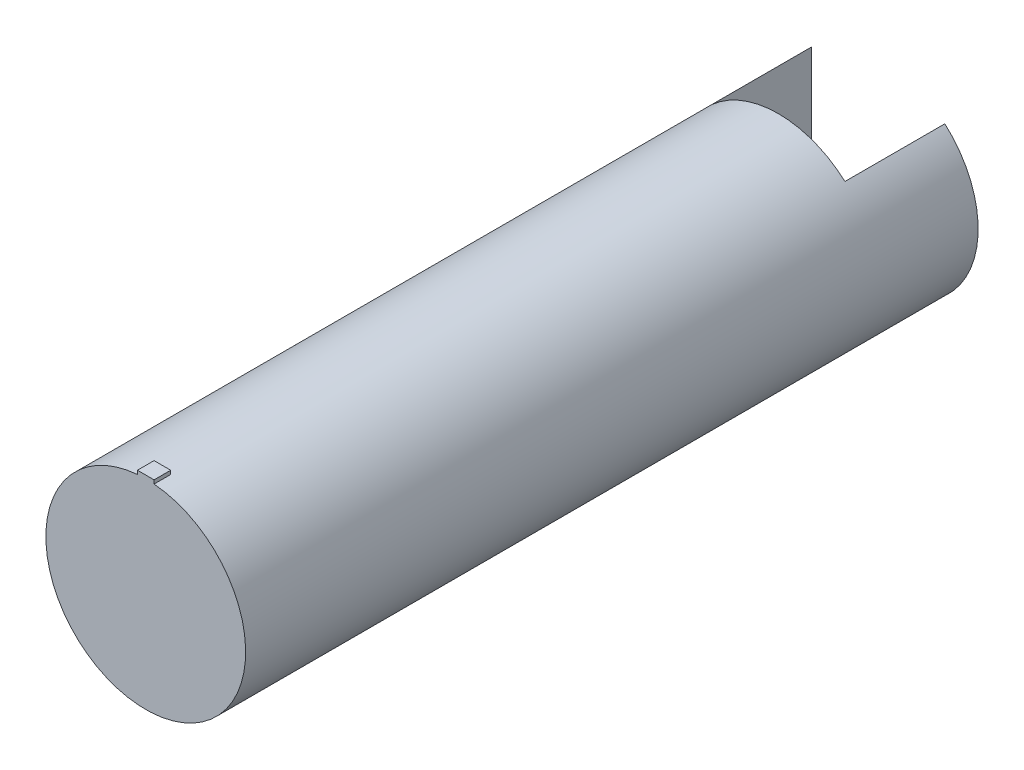
ISO-10303-21;
HEADER;
FILE_DESCRIPTION(('STEP AP214'),'2;1');
FILE_NAME('part.step','',(''),(''),'','','');
FILE_SCHEMA(('AUTOMOTIVE_DESIGN { 1 0 10303 214 1 1 1 1 }'));
ENDSEC;
DATA;
#1=APPLICATION_CONTEXT('core data for automotive mechanical design processes');
#2=APPLICATION_PROTOCOL_DEFINITION('international standard','automotive_design',2000,#1);
#3=PRODUCT_CONTEXT('',#1,'mechanical');
#4=PRODUCT('Part','Part','',(#3));
#5=PRODUCT_RELATED_PRODUCT_CATEGORY('part','',(#4));
#6=PRODUCT_DEFINITION_FORMATION('','',#4);
#7=PRODUCT_DEFINITION_CONTEXT('part definition',#1,'design');
#8=PRODUCT_DEFINITION('design','',#6,#7);
#9=PRODUCT_DEFINITION_SHAPE('','',#8);
#10=(LENGTH_UNIT() NAMED_UNIT(*) SI_UNIT(.MILLI.,.METRE.));
#11=(NAMED_UNIT(*) PLANE_ANGLE_UNIT() SI_UNIT($,.RADIAN.));
#12=(NAMED_UNIT(*) SI_UNIT($,.STERADIAN.) SOLID_ANGLE_UNIT());
#13=UNCERTAINTY_MEASURE_WITH_UNIT(LENGTH_MEASURE(1.E-05),#10,'distance_accuracy_value','');
#14=(GEOMETRIC_REPRESENTATION_CONTEXT(3) GLOBAL_UNCERTAINTY_ASSIGNED_CONTEXT((#13)) GLOBAL_UNIT_ASSIGNED_CONTEXT((#10,
#11,#12)) REPRESENTATION_CONTEXT('',''));
#15=CARTESIAN_POINT('',(0.,0.,0.));
#16=DIRECTION('',(0.,0.,1.));
#17=DIRECTION('',(1.,0.,0.));
#18=AXIS2_PLACEMENT_3D('',#15,#16,#17);
#19=CARTESIAN_POINT('',(0.,0.,220.));
#20=DIRECTION('',(0.,0.,-1.));
#21=DIRECTION('',(-1.,0.,0.));
#22=AXIS2_PLACEMENT_3D('',#19,#20,#21);
#23=CYLINDRICAL_SURFACE('',#22,30.);
#24=DIRECTION('',(0.,0.,-1.));
#25=VECTOR('',#24,1.);
#26=CARTESIAN_POINT('',(20.,22.3606797749979,220.));
#27=LINE('',#26,#25);
#28=CARTESIAN_POINT('',(20.,22.3606797749979,30.));
#29=VERTEX_POINT('',#28);
#30=CARTESIAN_POINT('',(20.,22.3606797749979,0.));
#31=VERTEX_POINT('',#30);
#32=EDGE_CURVE('E150',#29,#31,#27,.T.);
#33=ORIENTED_EDGE('',*,*,#32,.F.);
#34=CARTESIAN_POINT('',(0.,0.,30.));
#35=DIRECTION('',(0.,0.,1.));
#36=DIRECTION('',(1.,0.,0.));
#37=AXIS2_PLACEMENT_3D('',#34,#35,#36);
#38=CIRCLE('',#37,30.);
#39=CARTESIAN_POINT('',(-20.,22.3606797749979,30.));
#40=VERTEX_POINT('',#39);
#41=EDGE_CURVE('E40',#29,#40,#38,.T.);
#42=ORIENTED_EDGE('',*,*,#41,.T.);
#43=DIRECTION('',(0.,0.,-1.));
#44=VECTOR('',#43,1.);
#45=CARTESIAN_POINT('',(-20.,22.3606797749979,220.));
#46=LINE('',#45,#44);
#47=CARTESIAN_POINT('',(-20.,22.3606797749979,0.));
#48=VERTEX_POINT('',#47);
#49=EDGE_CURVE('E145',#48,#40,#46,.F.);
#50=ORIENTED_EDGE('',*,*,#49,.F.);
#51=CARTESIAN_POINT('',(0.,0.,0.));
#52=DIRECTION('',(0.,0.,1.));
#53=DIRECTION('',(1.,0.,0.));
#54=AXIS2_PLACEMENT_3D('',#51,#52,#53);
#55=CIRCLE('',#54,30.);
#56=CARTESIAN_POINT('',(-20.,-22.3606797749979,0.));
#57=VERTEX_POINT('',#56);
#58=EDGE_CURVE('E156',#48,#57,#55,.T.);
#59=ORIENTED_EDGE('',*,*,#58,.T.);
#60=DIRECTION('',(0.,0.,-1.));
#61=VECTOR('',#60,1.);
#62=CARTESIAN_POINT('',(-20.,-22.3606797749979,220.));
#63=LINE('',#62,#61);
#64=CARTESIAN_POINT('',(-20.,-22.3606797749979,30.));
#65=VERTEX_POINT('',#64);
#66=EDGE_CURVE('E55',#65,#57,#63,.T.);
#67=ORIENTED_EDGE('',*,*,#66,.F.);
#68=CARTESIAN_POINT('',(20.,-22.3606797749979,30.));
#69=VERTEX_POINT('',#68);
#70=EDGE_CURVE('E161',#65,#69,#38,.T.);
#71=ORIENTED_EDGE('',*,*,#70,.T.);
#72=DIRECTION('',(0.,0.,-1.));
#73=VECTOR('',#72,1.);
#74=CARTESIAN_POINT('',(20.,-22.3606797749979,220.));
#75=LINE('',#74,#73);
#76=CARTESIAN_POINT('',(20.,-22.3606797749979,0.));
#77=VERTEX_POINT('',#76);
#78=EDGE_CURVE('E148',#77,#69,#75,.F.);
#79=ORIENTED_EDGE('',*,*,#78,.F.);
#80=EDGE_CURVE('E152',#77,#31,#55,.T.);
#81=ORIENTED_EDGE('',*,*,#80,.T.);
#82=EDGE_LOOP('',(#33,#42,#50,#59,#67,#71,#79,#81));
#83=FACE_BOUND('',#82,.T.);
#84=DIRECTION('',(0.,0.,-1.));
#85=VECTOR('',#84,1.);
#86=CARTESIAN_POINT('',(2.5,29.8956518577535,220.));
#87=LINE('',#86,#85);
#88=CARTESIAN_POINT('',(2.5,29.8956518577535,220.));
#89=VERTEX_POINT('',#88);
#90=CARTESIAN_POINT('',(2.5,29.8956518577535,215.));
#91=VERTEX_POINT('',#90);
#92=EDGE_CURVE('E120',#89,#91,#87,.T.);
#93=ORIENTED_EDGE('',*,*,#92,.F.);
#94=CARTESIAN_POINT('',(0.,0.,220.));
#95=DIRECTION('',(0.,0.,1.));
#96=DIRECTION('',(1.,0.,0.));
#97=AXIS2_PLACEMENT_3D('',#94,#95,#96);
#98=CIRCLE('',#97,30.);
#99=CARTESIAN_POINT('',(-2.5,29.8956518577535,220.));
#100=VERTEX_POINT('',#99);
#101=EDGE_CURVE('E153',#100,#89,#98,.T.);
#102=ORIENTED_EDGE('',*,*,#101,.F.);
#103=DIRECTION('',(0.,0.,-1.));
#104=VECTOR('',#103,1.);
#105=CARTESIAN_POINT('',(-2.5,29.8956518577535,220.));
#106=LINE('',#105,#104);
#107=CARTESIAN_POINT('',(-2.5,29.8956518577535,215.));
#108=VERTEX_POINT('',#107);
#109=EDGE_CURVE('E121',#108,#100,#106,.F.);
#110=ORIENTED_EDGE('',*,*,#109,.F.);
#111=CARTESIAN_POINT('',(0.,0.,215.));
#112=DIRECTION('',(0.,0.,1.));
#113=DIRECTION('',(1.,0.,0.));
#114=AXIS2_PLACEMENT_3D('',#111,#112,#113);
#115=CIRCLE('',#114,30.);
#116=EDGE_CURVE('E11',#91,#108,#115,.T.);
#117=ORIENTED_EDGE('',*,*,#116,.F.);
#118=EDGE_LOOP('',(#93,#102,#110,#117));
#119=FACE_BOUND('',#118,.T.);
#120=ADVANCED_FACE('F33',(#83,#119),#23,.T.);
#121=CARTESIAN_POINT('',(0.,0.,0.));
#122=DIRECTION('',(0.,0.,1.));
#123=DIRECTION('',(1.,0.,0.));
#124=AXIS2_PLACEMENT_3D('',#121,#122,#123);
#125=PLANE('',#124);
#126=DIRECTION('',(0.,-1.,0.));
#127=VECTOR('',#126,1.);
#128=CARTESIAN_POINT('',(20.,0.,0.));
#129=LINE('',#128,#127);
#130=EDGE_CURVE('E160',#31,#77,#129,.T.);
#131=ORIENTED_EDGE('',*,*,#130,.F.);
#132=ORIENTED_EDGE('',*,*,#80,.F.);
#133=EDGE_LOOP('',(#131,#132));
#134=FACE_BOUND('',#133,.T.);
#135=ADVANCED_FACE('F180',(#134),#125,.F.);
#136=DIRECTION('',(0.,1.,0.));
#137=VECTOR('',#136,1.);
#138=CARTESIAN_POINT('',(-20.,0.,0.));
#139=LINE('',#138,#137);
#140=EDGE_CURVE('E155',#57,#48,#139,.T.);
#141=ORIENTED_EDGE('',*,*,#140,.F.);
#142=ORIENTED_EDGE('',*,*,#58,.F.);
#143=EDGE_LOOP('',(#141,#142));
#144=FACE_BOUND('',#143,.T.);
#145=ADVANCED_FACE('F182',(#144),#125,.F.);
#146=CARTESIAN_POINT('',(0.,0.,220.));
#147=DIRECTION('',(0.,0.,1.));
#148=DIRECTION('',(1.,0.,0.));
#149=AXIS2_PLACEMENT_3D('',#146,#147,#148);
#150=PLANE('',#149);
#151=ORIENTED_EDGE('',*,*,#101,.T.);
#152=DIRECTION('',(0.,-1.,0.));
#153=VECTOR('',#152,1.);
#154=CARTESIAN_POINT('',(2.5,31.,220.));
#155=LINE('',#154,#153);
#156=CARTESIAN_POINT('',(2.5,31.,220.));
#157=VERTEX_POINT('',#156);
#158=EDGE_CURVE('E319',#157,#89,#155,.T.);
#159=ORIENTED_EDGE('',*,*,#158,.F.);
#160=DIRECTION('',(1.,0.,0.));
#161=VECTOR('',#160,1.);
#162=CARTESIAN_POINT('',(-2.5,31.,220.));
#163=LINE('',#162,#161);
#164=CARTESIAN_POINT('',(-2.5,31.,220.));
#165=VERTEX_POINT('',#164);
#166=EDGE_CURVE('E114',#165,#157,#163,.T.);
#167=ORIENTED_EDGE('',*,*,#166,.F.);
#168=DIRECTION('',(0.,-1.,0.));
#169=VECTOR('',#168,1.);
#170=CARTESIAN_POINT('',(-2.5,31.,220.));
#171=LINE('',#170,#169);
#172=EDGE_CURVE('E47',#165,#100,#171,.T.);
#173=ORIENTED_EDGE('',*,*,#172,.T.);
#174=EDGE_LOOP('',(#151,#159,#167,#173));
#175=FACE_BOUND('',#174,.T.);
#176=ADVANCED_FACE('F187',(#175),#150,.T.);
#177=CARTESIAN_POINT('',(0.,0.,30.));
#178=DIRECTION('',(0.,0.,1.));
#179=DIRECTION('',(1.,0.,0.));
#180=AXIS2_PLACEMENT_3D('',#177,#178,#179);
#181=PLANE('',#180);
#182=DIRECTION('',(0.,1.,0.));
#183=VECTOR('',#182,1.);
#184=CARTESIAN_POINT('',(20.,30.,30.));
#185=LINE('',#184,#183);
#186=EDGE_CURVE('E138',#69,#29,#185,.T.);
#187=ORIENTED_EDGE('',*,*,#186,.F.);
#188=ORIENTED_EDGE('',*,*,#70,.F.);
#189=DIRECTION('',(0.,-1.,0.));
#190=VECTOR('',#189,1.);
#191=CARTESIAN_POINT('',(-20.,30.,30.));
#192=LINE('',#191,#190);
#193=EDGE_CURVE('E143',#40,#65,#192,.T.);
#194=ORIENTED_EDGE('',*,*,#193,.F.);
#195=ORIENTED_EDGE('',*,*,#41,.F.);
#196=EDGE_LOOP('',(#187,#188,#194,#195));
#197=FACE_BOUND('',#196,.T.);
#198=ADVANCED_FACE('F174',(#197),#181,.F.);
#199=CARTESIAN_POINT('',(20.,30.,30.));
#200=DIRECTION('',(-1.,0.,0.));
#201=DIRECTION('',(0.,-1.,0.));
#202=AXIS2_PLACEMENT_3D('',#199,#200,#201);
#203=PLANE('',#202);
#204=CARTESIAN_POINT('',(20.,0.,7.04424442955087));
#205=DIRECTION('',(-1.,0.,0.));
#206=DIRECTION('',(0.,-1.,0.));
#207=AXIS2_PLACEMENT_3D('',#204,#205,#206);
#208=CIRCLE('',#207,2.5);
#209=CARTESIAN_POINT('',(20.,-2.5,7.04424442955087));
#210=VERTEX_POINT('',#209);
#211=EDGE_CURVE('E132',#210,#210,#208,.T.);
#212=ORIENTED_EDGE('',*,*,#211,.F.);
#213=EDGE_LOOP('',(#212));
#214=FACE_BOUND('',#213,.T.);
#215=ORIENTED_EDGE('',*,*,#32,.T.);
#216=ORIENTED_EDGE('',*,*,#130,.T.);
#217=ORIENTED_EDGE('',*,*,#78,.T.);
#218=ORIENTED_EDGE('',*,*,#186,.T.);
#219=EDGE_LOOP('',(#215,#216,#217,#218));
#220=FACE_BOUND('',#219,.T.);
#221=ADVANCED_FACE('F176',(#214,#220),#203,.T.);
#222=CARTESIAN_POINT('',(-20.,30.,30.));
#223=DIRECTION('',(1.,0.,0.));
#224=DIRECTION('',(0.,1.,0.));
#225=AXIS2_PLACEMENT_3D('',#222,#223,#224);
#226=PLANE('',#225);
#227=CARTESIAN_POINT('',(-20.,0.,7.04424442955087));
#228=DIRECTION('',(-1.,0.,0.));
#229=DIRECTION('',(0.,-1.,0.));
#230=AXIS2_PLACEMENT_3D('',#227,#228,#229);
#231=CIRCLE('',#230,2.5);
#232=CARTESIAN_POINT('',(-20.,-2.5,7.04424442955087));
#233=VERTEX_POINT('',#232);
#234=EDGE_CURVE('E128',#233,#233,#231,.T.);
#235=ORIENTED_EDGE('',*,*,#234,.T.);
#236=EDGE_LOOP('',(#235));
#237=FACE_BOUND('',#236,.T.);
#238=ORIENTED_EDGE('',*,*,#66,.T.);
#239=ORIENTED_EDGE('',*,*,#140,.T.);
#240=ORIENTED_EDGE('',*,*,#49,.T.);
#241=ORIENTED_EDGE('',*,*,#193,.T.);
#242=EDGE_LOOP('',(#238,#239,#240,#241));
#243=FACE_BOUND('',#242,.T.);
#244=ADVANCED_FACE('F194',(#237,#243),#226,.T.);
#245=CARTESIAN_POINT('',(25.,0.,7.04424442955087));
#246=DIRECTION('',(-1.,0.,0.));
#247=DIRECTION('',(0.,-1.,0.));
#248=AXIS2_PLACEMENT_3D('',#245,#246,#247);
#249=CYLINDRICAL_SURFACE('',#248,2.5);
#250=CARTESIAN_POINT('',(25.,0.,7.04424442955087));
#251=DIRECTION('',(-1.,0.,0.));
#252=DIRECTION('',(0.,-1.,0.));
#253=AXIS2_PLACEMENT_3D('',#250,#251,#252);
#254=CIRCLE('',#253,2.5);
#255=CARTESIAN_POINT('',(25.,-2.5,7.04424442955087));
#256=VERTEX_POINT('',#255);
#257=EDGE_CURVE('E135',#256,#256,#254,.T.);
#258=ORIENTED_EDGE('',*,*,#257,.F.);
#259=EDGE_LOOP('',(#258));
#260=FACE_BOUND('',#259,.T.);
#261=ORIENTED_EDGE('',*,*,#211,.T.);
#262=EDGE_LOOP('',(#261));
#263=FACE_BOUND('',#262,.T.);
#264=ADVANCED_FACE('F198',(#260,#263),#249,.F.);
#265=CARTESIAN_POINT('',(25.,0.,7.04424442955087));
#266=DIRECTION('',(-1.,0.,0.));
#267=DIRECTION('',(0.,-1.,0.));
#268=AXIS2_PLACEMENT_3D('',#265,#266,#267);
#269=PLANE('',#268);
#270=ORIENTED_EDGE('',*,*,#257,.T.);
#271=EDGE_LOOP('',(#270));
#272=FACE_BOUND('',#271,.T.);
#273=ADVANCED_FACE('F204',(#272),#269,.T.);
#274=CARTESIAN_POINT('',(-25.,0.,7.04424442955087));
#275=DIRECTION('',(1.,0.,0.));
#276=DIRECTION('',(0.,1.,0.));
#277=AXIS2_PLACEMENT_3D('',#274,#275,#276);
#278=CYLINDRICAL_SURFACE('',#277,2.5);
#279=CARTESIAN_POINT('',(-25.,0.,7.04424442955087));
#280=DIRECTION('',(-1.,0.,0.));
#281=DIRECTION('',(0.,-1.,0.));
#282=AXIS2_PLACEMENT_3D('',#279,#280,#281);
#283=CIRCLE('',#282,2.5);
#284=CARTESIAN_POINT('',(-25.,-2.5,7.04424442955087));
#285=VERTEX_POINT('',#284);
#286=EDGE_CURVE('E129',#285,#285,#283,.T.);
#287=ORIENTED_EDGE('',*,*,#286,.T.);
#288=EDGE_LOOP('',(#287));
#289=FACE_BOUND('',#288,.T.);
#290=ORIENTED_EDGE('',*,*,#234,.F.);
#291=EDGE_LOOP('',(#290));
#292=FACE_BOUND('',#291,.T.);
#293=ADVANCED_FACE('F208',(#289,#292),#278,.F.);
#294=CARTESIAN_POINT('',(-25.,0.,7.04424442955087));
#295=DIRECTION('',(1.,0.,0.));
#296=DIRECTION('',(0.,-1.,0.));
#297=AXIS2_PLACEMENT_3D('',#294,#295,#296);
#298=PLANE('',#297);
#299=ORIENTED_EDGE('',*,*,#286,.F.);
#300=EDGE_LOOP('',(#299));
#301=FACE_BOUND('',#300,.T.);
#302=ADVANCED_FACE('F212',(#301),#298,.T.);
#303=CARTESIAN_POINT('',(2.5,31.,215.));
#304=DIRECTION('',(-1.,0.,0.));
#305=DIRECTION('',(0.,0.,1.));
#306=AXIS2_PLACEMENT_3D('',#303,#304,#305);
#307=PLANE('',#306);
#308=ORIENTED_EDGE('',*,*,#158,.T.);
#309=ORIENTED_EDGE('',*,*,#92,.T.);
#310=DIRECTION('',(0.,-1.,0.));
#311=VECTOR('',#310,1.);
#312=CARTESIAN_POINT('',(2.5,31.,215.));
#313=LINE('',#312,#311);
#314=CARTESIAN_POINT('',(2.5,31.,215.));
#315=VERTEX_POINT('',#314);
#316=EDGE_CURVE('E103',#315,#91,#313,.T.);
#317=ORIENTED_EDGE('',*,*,#316,.F.);
#318=DIRECTION('',(0.,0.,-1.));
#319=VECTOR('',#318,1.);
#320=CARTESIAN_POINT('',(2.5,31.,215.));
#321=LINE('',#320,#319);
#322=EDGE_CURVE('E110',#157,#315,#321,.T.);
#323=ORIENTED_EDGE('',*,*,#322,.F.);
#324=EDGE_LOOP('',(#308,#309,#317,#323));
#325=FACE_BOUND('',#324,.T.);
#326=ADVANCED_FACE('F118',(#325),#307,.F.);
#327=CARTESIAN_POINT('',(-2.5,31.,215.));
#328=DIRECTION('',(1.,0.,0.));
#329=DIRECTION('',(0.,0.,-1.));
#330=AXIS2_PLACEMENT_3D('',#327,#328,#329);
#331=PLANE('',#330);
#332=DIRECTION('',(0.,-1.,0.));
#333=VECTOR('',#332,1.);
#334=CARTESIAN_POINT('',(-2.5,31.,215.));
#335=LINE('',#334,#333);
#336=CARTESIAN_POINT('',(-2.5,31.,215.));
#337=VERTEX_POINT('',#336);
#338=EDGE_CURVE('E106',#337,#108,#335,.T.);
#339=ORIENTED_EDGE('',*,*,#338,.T.);
#340=ORIENTED_EDGE('',*,*,#109,.T.);
#341=ORIENTED_EDGE('',*,*,#172,.F.);
#342=DIRECTION('',(0.,0.,1.));
#343=VECTOR('',#342,1.);
#344=CARTESIAN_POINT('',(-2.5,31.,215.));
#345=LINE('',#344,#343);
#346=EDGE_CURVE('E109',#337,#165,#345,.T.);
#347=ORIENTED_EDGE('',*,*,#346,.F.);
#348=EDGE_LOOP('',(#339,#340,#341,#347));
#349=FACE_BOUND('',#348,.T.);
#350=ADVANCED_FACE('F219',(#349),#331,.F.);
#351=CARTESIAN_POINT('',(-2.5,31.,215.));
#352=DIRECTION('',(0.,0.,1.));
#353=DIRECTION('',(1.,0.,0.));
#354=AXIS2_PLACEMENT_3D('',#351,#352,#353);
#355=PLANE('',#354);
#356=ORIENTED_EDGE('',*,*,#316,.T.);
#357=ORIENTED_EDGE('',*,*,#116,.T.);
#358=ORIENTED_EDGE('',*,*,#338,.F.);
#359=DIRECTION('',(-1.,0.,0.));
#360=VECTOR('',#359,1.);
#361=CARTESIAN_POINT('',(-2.5,31.,215.));
#362=LINE('',#361,#360);
#363=EDGE_CURVE('E99',#315,#337,#362,.T.);
#364=ORIENTED_EDGE('',*,*,#363,.F.);
#365=EDGE_LOOP('',(#356,#357,#358,#364));
#366=FACE_BOUND('',#365,.T.);
#367=ADVANCED_FACE('F101',(#366),#355,.F.);
#368=CARTESIAN_POINT('',(0.,31.,0.));
#369=DIRECTION('',(0.,1.,0.));
#370=DIRECTION('',(0.,0.,1.));
#371=AXIS2_PLACEMENT_3D('',#368,#369,#370);
#372=PLANE('',#371);
#373=ORIENTED_EDGE('',*,*,#322,.T.);
#374=ORIENTED_EDGE('',*,*,#363,.T.);
#375=ORIENTED_EDGE('',*,*,#346,.T.);
#376=ORIENTED_EDGE('',*,*,#166,.T.);
#377=EDGE_LOOP('',(#373,#374,#375,#376));
#378=FACE_BOUND('',#377,.T.);
#379=ADVANCED_FACE('F113',(#378),#372,.T.);
#380=CLOSED_SHELL('',(#120,#135,#145,#176,#198,#221,#244,#264,#273,#293,#302,#326,#350,#367,#379));
#381=MANIFOLD_SOLID_BREP('B2',#380);
#382=ADVANCED_BREP_SHAPE_REPRESENTATION('',(#18,#381),#14);
#383=SHAPE_DEFINITION_REPRESENTATION(#9,#382);
ENDSEC;
END-ISO-10303-21;
